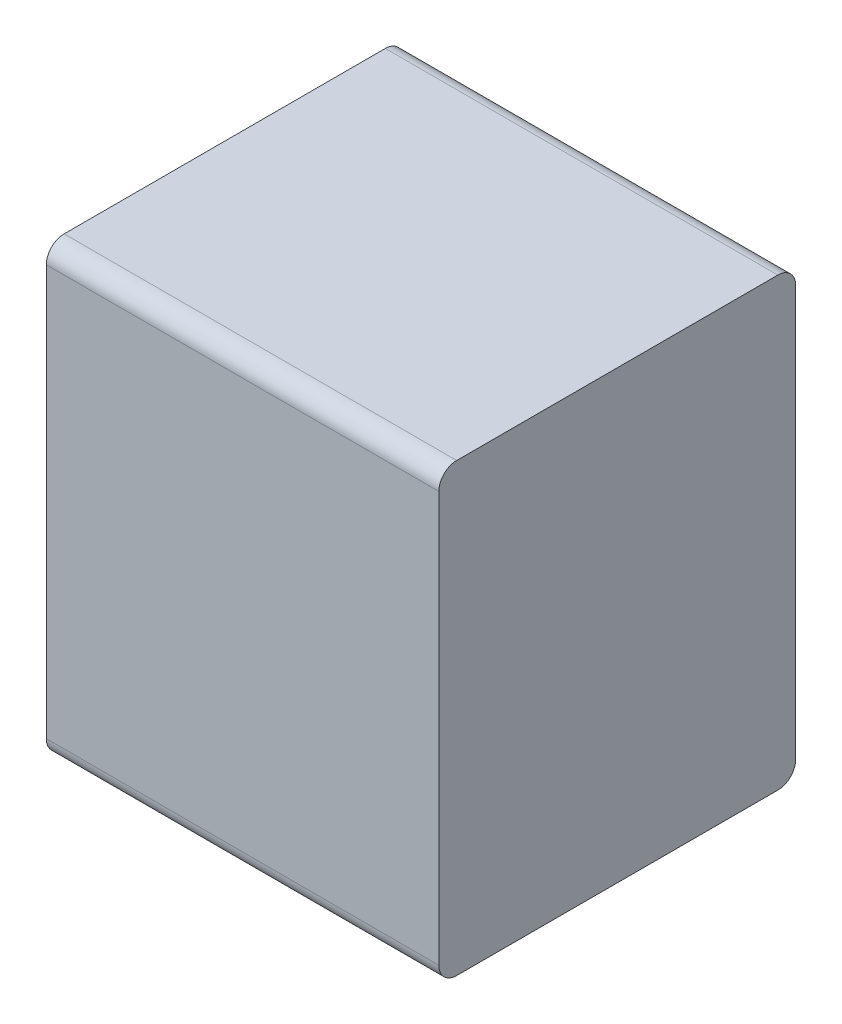
ISO-10303-21;
HEADER;
FILE_DESCRIPTION(('STEP AP214'),'2;1');
FILE_NAME('part.step','',(''),(''),'','','');
FILE_SCHEMA(('AUTOMOTIVE_DESIGN { 1 0 10303 214 1 1 1 1 }'));
ENDSEC;
DATA;
#1=APPLICATION_CONTEXT('core data for automotive mechanical design processes');
#2=APPLICATION_PROTOCOL_DEFINITION('international standard','automotive_design',2000,#1);
#3=PRODUCT_CONTEXT('',#1,'mechanical');
#4=PRODUCT('Part','Part','',(#3));
#5=PRODUCT_RELATED_PRODUCT_CATEGORY('part','',(#4));
#6=PRODUCT_DEFINITION_FORMATION('','',#4);
#7=PRODUCT_DEFINITION_CONTEXT('part definition',#1,'design');
#8=PRODUCT_DEFINITION('design','',#6,#7);
#9=PRODUCT_DEFINITION_SHAPE('','',#8);
#10=(LENGTH_UNIT() NAMED_UNIT(*) SI_UNIT(.MILLI.,.METRE.));
#11=(NAMED_UNIT(*) PLANE_ANGLE_UNIT() SI_UNIT($,.RADIAN.));
#12=(NAMED_UNIT(*) SI_UNIT($,.STERADIAN.) SOLID_ANGLE_UNIT());
#13=UNCERTAINTY_MEASURE_WITH_UNIT(LENGTH_MEASURE(1.E-05),#10,'distance_accuracy_value','');
#14=(GEOMETRIC_REPRESENTATION_CONTEXT(3) GLOBAL_UNCERTAINTY_ASSIGNED_CONTEXT((#13)) GLOBAL_UNIT_ASSIGNED_CONTEXT((#10,
#11,#12)) REPRESENTATION_CONTEXT('',''));
#15=CARTESIAN_POINT('',(0.,0.,0.));
#16=DIRECTION('',(0.,0.,1.));
#17=DIRECTION('',(1.,0.,0.));
#18=AXIS2_PLACEMENT_3D('',#15,#16,#17);
#19=CARTESIAN_POINT('',(0.,0.,0.));
#20=DIRECTION('',(0.,0.,1.));
#21=DIRECTION('',(1.,0.,0.));
#22=AXIS2_PLACEMENT_3D('',#19,#20,#21);
#23=PLANE('',#22);
#24=DIRECTION('',(-1.,0.,0.));
#25=VECTOR('',#24,1.);
#26=CARTESIAN_POINT('',(0.275,0.575,0.));
#27=LINE('',#26,#25);
#28=CARTESIAN_POINT('',(0.55,0.575,0.));
#29=VERTEX_POINT('',#28);
#30=CARTESIAN_POINT('',(-0.55,0.575,0.));
#31=VERTEX_POINT('',#30);
#32=EDGE_CURVE('E150',#29,#31,#27,.T.);
#33=ORIENTED_EDGE('',*,*,#32,.F.);
#34=DIRECTION('',(0.,-1.,0.));
#35=VECTOR('',#34,1.);
#36=CARTESIAN_POINT('',(0.55,0.625,0.));
#37=LINE('',#36,#35);
#38=CARTESIAN_POINT('',(0.55,-0.575,0.));
#39=VERTEX_POINT('',#38);
#40=EDGE_CURVE('E21',#29,#39,#37,.T.);
#41=ORIENTED_EDGE('',*,*,#40,.T.);
#42=DIRECTION('',(1.,0.,0.));
#43=VECTOR('',#42,1.);
#44=CARTESIAN_POINT('',(-0.275,-0.575,0.));
#45=LINE('',#44,#43);
#46=CARTESIAN_POINT('',(-0.55,-0.575,0.));
#47=VERTEX_POINT('',#46);
#48=EDGE_CURVE('E170',#47,#39,#45,.T.);
#49=ORIENTED_EDGE('',*,*,#48,.F.);
#50=DIRECTION('',(0.,1.,0.));
#51=VECTOR('',#50,1.);
#52=CARTESIAN_POINT('',(-0.55,-0.625,0.));
#53=LINE('',#52,#51);
#54=EDGE_CURVE('E92',#47,#31,#53,.T.);
#55=ORIENTED_EDGE('',*,*,#54,.T.);
#56=EDGE_LOOP('',(#33,#41,#49,#55));
#57=FACE_BOUND('',#56,.T.);
#58=ADVANCED_FACE('F17',(#57),#23,.F.);
#59=CARTESIAN_POINT('',(-0.275,-0.575,0.95));
#60=DIRECTION('',(1.,0.,0.));
#61=DIRECTION('',(0.,-0.707106781186548,0.707106781186548));
#62=AXIS2_PLACEMENT_3D('',#59,#60,#61);
#63=CYLINDRICAL_SURFACE('',#62,0.05);
#64=CARTESIAN_POINT('',(0.55,-0.575,0.95));
#65=DIRECTION('',(-1.,0.,0.));
#66=DIRECTION('',(0.,-0.707106781186548,0.707106781186548));
#67=AXIS2_PLACEMENT_3D('',#64,#65,#66);
#68=CIRCLE('',#67,0.05);
#69=CARTESIAN_POINT('',(0.55,-0.625,0.95));
#70=VERTEX_POINT('',#69);
#71=CARTESIAN_POINT('',(0.55,-0.575,1.));
#72=VERTEX_POINT('',#71);
#73=EDGE_CURVE('E123',#70,#72,#68,.T.);
#74=ORIENTED_EDGE('',*,*,#73,.T.);
#75=DIRECTION('',(-1.,0.,0.));
#76=VECTOR('',#75,1.);
#77=CARTESIAN_POINT('',(-0.275,-0.575,1.));
#78=LINE('',#77,#76);
#79=CARTESIAN_POINT('',(-0.55,-0.575,1.));
#80=VERTEX_POINT('',#79);
#81=EDGE_CURVE('E11',#72,#80,#78,.T.);
#82=ORIENTED_EDGE('',*,*,#81,.T.);
#83=CARTESIAN_POINT('',(-0.55,-0.575,0.95));
#84=DIRECTION('',(1.,0.,0.));
#85=DIRECTION('',(0.,-0.707106781186548,0.707106781186548));
#86=AXIS2_PLACEMENT_3D('',#83,#84,#85);
#87=CIRCLE('',#86,0.05);
#88=CARTESIAN_POINT('',(-0.55,-0.625,0.95));
#89=VERTEX_POINT('',#88);
#90=EDGE_CURVE('E159',#80,#89,#87,.T.);
#91=ORIENTED_EDGE('',*,*,#90,.T.);
#92=DIRECTION('',(1.,0.,0.));
#93=VECTOR('',#92,1.);
#94=CARTESIAN_POINT('',(-0.275,-0.625,0.95));
#95=LINE('',#94,#93);
#96=EDGE_CURVE('E183',#89,#70,#95,.T.);
#97=ORIENTED_EDGE('',*,*,#96,.T.);
#98=EDGE_LOOP('',(#74,#82,#91,#97));
#99=FACE_BOUND('',#98,.T.);
#100=ADVANCED_FACE('F216',(#99),#63,.T.);
#101=CARTESIAN_POINT('',(0.,0.,1.));
#102=DIRECTION('',(0.,0.,1.));
#103=DIRECTION('',(1.,0.,0.));
#104=AXIS2_PLACEMENT_3D('',#101,#102,#103);
#105=PLANE('',#104);
#106=DIRECTION('',(1.,0.,0.));
#107=VECTOR('',#106,1.);
#108=CARTESIAN_POINT('',(0.275,0.575,1.));
#109=LINE('',#108,#107);
#110=CARTESIAN_POINT('',(-0.55,0.575,1.));
#111=VERTEX_POINT('',#110);
#112=CARTESIAN_POINT('',(0.55,0.575,1.));
#113=VERTEX_POINT('',#112);
#114=EDGE_CURVE('E28',#111,#113,#109,.T.);
#115=ORIENTED_EDGE('',*,*,#114,.F.);
#116=DIRECTION('',(0.,-1.,0.));
#117=VECTOR('',#116,1.);
#118=CARTESIAN_POINT('',(-0.55,-0.625,1.));
#119=LINE('',#118,#117);
#120=EDGE_CURVE('E171',#111,#80,#119,.T.);
#121=ORIENTED_EDGE('',*,*,#120,.T.);
#122=ORIENTED_EDGE('',*,*,#81,.F.);
#123=DIRECTION('',(0.,1.,0.));
#124=VECTOR('',#123,1.);
#125=CARTESIAN_POINT('',(0.55,0.625,1.));
#126=LINE('',#125,#124);
#127=EDGE_CURVE('E173',#72,#113,#126,.T.);
#128=ORIENTED_EDGE('',*,*,#127,.T.);
#129=EDGE_LOOP('',(#115,#121,#122,#128));
#130=FACE_BOUND('',#129,.T.);
#131=ADVANCED_FACE('F227',(#130),#105,.T.);
#132=CARTESIAN_POINT('',(0.275,0.575,0.95));
#133=DIRECTION('',(-1.,0.,0.));
#134=DIRECTION('',(0.,0.707106781186548,0.707106781186548));
#135=AXIS2_PLACEMENT_3D('',#132,#133,#134);
#136=CYLINDRICAL_SURFACE('',#135,0.05);
#137=CARTESIAN_POINT('',(-0.55,0.575,0.95));
#138=DIRECTION('',(1.,0.,0.));
#139=DIRECTION('',(0.,0.707106781186548,0.707106781186548));
#140=AXIS2_PLACEMENT_3D('',#137,#138,#139);
#141=CIRCLE('',#140,0.05);
#142=CARTESIAN_POINT('',(-0.55,0.625,0.95));
#143=VERTEX_POINT('',#142);
#144=EDGE_CURVE('E74',#143,#111,#141,.T.);
#145=ORIENTED_EDGE('',*,*,#144,.T.);
#146=ORIENTED_EDGE('',*,*,#114,.T.);
#147=CARTESIAN_POINT('',(0.55,0.575,0.95));
#148=DIRECTION('',(-1.,0.,0.));
#149=DIRECTION('',(0.,0.707106781186548,0.707106781186548));
#150=AXIS2_PLACEMENT_3D('',#147,#148,#149);
#151=CIRCLE('',#150,0.05);
#152=CARTESIAN_POINT('',(0.55,0.625,0.95));
#153=VERTEX_POINT('',#152);
#154=EDGE_CURVE('E63',#113,#153,#151,.T.);
#155=ORIENTED_EDGE('',*,*,#154,.T.);
#156=DIRECTION('',(-1.,0.,0.));
#157=VECTOR('',#156,1.);
#158=CARTESIAN_POINT('',(0.275,0.625,0.95));
#159=LINE('',#158,#157);
#160=EDGE_CURVE('E136',#153,#143,#159,.T.);
#161=ORIENTED_EDGE('',*,*,#160,.T.);
#162=EDGE_LOOP('',(#145,#146,#155,#161));
#163=FACE_BOUND('',#162,.T.);
#164=ADVANCED_FACE('F19',(#163),#136,.T.);
#165=CARTESIAN_POINT('',(0.55,-0.625,0.));
#166=DIRECTION('',(1.,0.,0.));
#167=DIRECTION('',(0.,1.,0.));
#168=AXIS2_PLACEMENT_3D('',#165,#166,#167);
#169=PLANE('',#168);
#170=CARTESIAN_POINT('',(0.55,0.575,0.05));
#171=DIRECTION('',(-1.,0.,0.));
#172=DIRECTION('',(0.,0.707106781186548,-0.707106781186548));
#173=AXIS2_PLACEMENT_3D('',#170,#171,#172);
#174=CIRCLE('',#173,0.05);
#175=CARTESIAN_POINT('',(0.55,0.625,0.05));
#176=VERTEX_POINT('',#175);
#177=EDGE_CURVE('E144',#176,#29,#174,.T.);
#178=ORIENTED_EDGE('',*,*,#177,.F.);
#179=DIRECTION('',(0.,0.,1.));
#180=VECTOR('',#179,1.);
#181=CARTESIAN_POINT('',(0.55,0.625,0.));
#182=LINE('',#181,#180);
#183=EDGE_CURVE('E131',#176,#153,#182,.T.);
#184=ORIENTED_EDGE('',*,*,#183,.T.);
#185=ORIENTED_EDGE('',*,*,#154,.F.);
#186=ORIENTED_EDGE('',*,*,#127,.F.);
#187=ORIENTED_EDGE('',*,*,#73,.F.);
#188=DIRECTION('',(0.,0.,1.));
#189=VECTOR('',#188,1.);
#190=CARTESIAN_POINT('',(0.55,-0.625,0.));
#191=LINE('',#190,#189);
#192=CARTESIAN_POINT('',(0.55,-0.625,0.05));
#193=VERTEX_POINT('',#192);
#194=EDGE_CURVE('E116',#193,#70,#191,.T.);
#195=ORIENTED_EDGE('',*,*,#194,.F.);
#196=CARTESIAN_POINT('',(0.55,-0.575,0.05));
#197=DIRECTION('',(-1.,0.,0.));
#198=DIRECTION('',(0.,-0.707106781186548,-0.707106781186548));
#199=AXIS2_PLACEMENT_3D('',#196,#197,#198);
#200=CIRCLE('',#199,0.05);
#201=EDGE_CURVE('E187',#39,#193,#200,.T.);
#202=ORIENTED_EDGE('',*,*,#201,.F.);
#203=ORIENTED_EDGE('',*,*,#40,.F.);
#204=EDGE_LOOP('',(#178,#184,#185,#186,#187,#195,#202,#203));
#205=FACE_BOUND('',#204,.T.);
#206=ADVANCED_FACE('F148',(#205),#169,.T.);
#207=CARTESIAN_POINT('',(-0.55,-0.625,0.));
#208=DIRECTION('',(0.,-1.,0.));
#209=DIRECTION('',(0.,0.,-1.));
#210=AXIS2_PLACEMENT_3D('',#207,#208,#209);
#211=PLANE('',#210);
#212=DIRECTION('',(-1.,0.,0.));
#213=VECTOR('',#212,1.);
#214=CARTESIAN_POINT('',(-0.275,-0.625,0.05));
#215=LINE('',#214,#213);
#216=CARTESIAN_POINT('',(-0.55,-0.625,0.05));
#217=VERTEX_POINT('',#216);
#218=EDGE_CURVE('E193',#193,#217,#215,.T.);
#219=ORIENTED_EDGE('',*,*,#218,.F.);
#220=ORIENTED_EDGE('',*,*,#194,.T.);
#221=ORIENTED_EDGE('',*,*,#96,.F.);
#222=DIRECTION('',(0.,0.,1.));
#223=VECTOR('',#222,1.);
#224=CARTESIAN_POINT('',(-0.55,-0.625,0.));
#225=LINE('',#224,#223);
#226=EDGE_CURVE('E168',#217,#89,#225,.T.);
#227=ORIENTED_EDGE('',*,*,#226,.F.);
#228=EDGE_LOOP('',(#219,#220,#221,#227));
#229=FACE_BOUND('',#228,.T.);
#230=ADVANCED_FACE('F219',(#229),#211,.T.);
#231=CARTESIAN_POINT('',(-0.275,-0.575,0.05));
#232=DIRECTION('',(-1.,0.,0.));
#233=DIRECTION('',(0.,-0.707106781186548,-0.707106781186548));
#234=AXIS2_PLACEMENT_3D('',#231,#232,#233);
#235=CYLINDRICAL_SURFACE('',#234,0.05);
#236=CARTESIAN_POINT('',(-0.55,-0.575,0.05));
#237=DIRECTION('',(1.,0.,0.));
#238=DIRECTION('',(0.,-0.707106781186548,-0.707106781186548));
#239=AXIS2_PLACEMENT_3D('',#236,#237,#238);
#240=CIRCLE('',#239,0.05);
#241=EDGE_CURVE('E164',#217,#47,#240,.T.);
#242=ORIENTED_EDGE('',*,*,#241,.T.);
#243=ORIENTED_EDGE('',*,*,#48,.T.);
#244=ORIENTED_EDGE('',*,*,#201,.T.);
#245=ORIENTED_EDGE('',*,*,#218,.T.);
#246=EDGE_LOOP('',(#242,#243,#244,#245));
#247=FACE_BOUND('',#246,.T.);
#248=ADVANCED_FACE('F220',(#247),#235,.T.);
#249=CARTESIAN_POINT('',(-0.55,0.625,0.));
#250=DIRECTION('',(-1.,0.,0.));
#251=DIRECTION('',(0.,1.,0.));
#252=AXIS2_PLACEMENT_3D('',#249,#250,#251);
#253=PLANE('',#252);
#254=CARTESIAN_POINT('',(-0.55,0.575,0.05));
#255=DIRECTION('',(1.,0.,0.));
#256=DIRECTION('',(0.,0.707106781186548,-0.707106781186548));
#257=AXIS2_PLACEMENT_3D('',#254,#255,#256);
#258=CIRCLE('',#257,0.05);
#259=CARTESIAN_POINT('',(-0.55,0.625,0.05));
#260=VERTEX_POINT('',#259);
#261=EDGE_CURVE('E145',#31,#260,#258,.T.);
#262=ORIENTED_EDGE('',*,*,#261,.F.);
#263=ORIENTED_EDGE('',*,*,#54,.F.);
#264=ORIENTED_EDGE('',*,*,#241,.F.);
#265=ORIENTED_EDGE('',*,*,#226,.T.);
#266=ORIENTED_EDGE('',*,*,#90,.F.);
#267=ORIENTED_EDGE('',*,*,#120,.F.);
#268=ORIENTED_EDGE('',*,*,#144,.F.);
#269=DIRECTION('',(0.,0.,1.));
#270=VECTOR('',#269,1.);
#271=CARTESIAN_POINT('',(-0.55,0.625,0.));
#272=LINE('',#271,#270);
#273=EDGE_CURVE('E80',#260,#143,#272,.T.);
#274=ORIENTED_EDGE('',*,*,#273,.F.);
#275=EDGE_LOOP('',(#262,#263,#264,#265,#266,#267,#268,#274));
#276=FACE_BOUND('',#275,.T.);
#277=ADVANCED_FACE('F218',(#276),#253,.T.);
#278=CARTESIAN_POINT('',(0.55,0.625,0.));
#279=DIRECTION('',(0.,1.,0.));
#280=DIRECTION('',(1.,0.,0.));
#281=AXIS2_PLACEMENT_3D('',#278,#279,#280);
#282=PLANE('',#281);
#283=DIRECTION('',(1.,0.,0.));
#284=VECTOR('',#283,1.);
#285=CARTESIAN_POINT('',(0.275,0.625,0.05));
#286=LINE('',#285,#284);
#287=EDGE_CURVE('E134',#260,#176,#286,.T.);
#288=ORIENTED_EDGE('',*,*,#287,.F.);
#289=ORIENTED_EDGE('',*,*,#273,.T.);
#290=ORIENTED_EDGE('',*,*,#160,.F.);
#291=ORIENTED_EDGE('',*,*,#183,.F.);
#292=EDGE_LOOP('',(#288,#289,#290,#291));
#293=FACE_BOUND('',#292,.T.);
#294=ADVANCED_FACE('F133',(#293),#282,.T.);
#295=CARTESIAN_POINT('',(0.275,0.575,0.05));
#296=DIRECTION('',(1.,0.,0.));
#297=DIRECTION('',(0.,0.707106781186548,-0.707106781186548));
#298=AXIS2_PLACEMENT_3D('',#295,#296,#297);
#299=CYLINDRICAL_SURFACE('',#298,0.05);
#300=ORIENTED_EDGE('',*,*,#177,.T.);
#301=ORIENTED_EDGE('',*,*,#32,.T.);
#302=ORIENTED_EDGE('',*,*,#261,.T.);
#303=ORIENTED_EDGE('',*,*,#287,.T.);
#304=EDGE_LOOP('',(#300,#301,#302,#303));
#305=FACE_BOUND('',#304,.T.);
#306=ADVANCED_FACE('F142',(#305),#299,.T.);
#307=CLOSED_SHELL('',(#58,#100,#131,#164,#206,#230,#248,#277,#294,#306));
#308=MANIFOLD_SOLID_BREP('B1',#307);
#309=ADVANCED_BREP_SHAPE_REPRESENTATION('',(#18,#308),#14);
#310=SHAPE_DEFINITION_REPRESENTATION(#9,#309);
ENDSEC;
END-ISO-10303-21;
